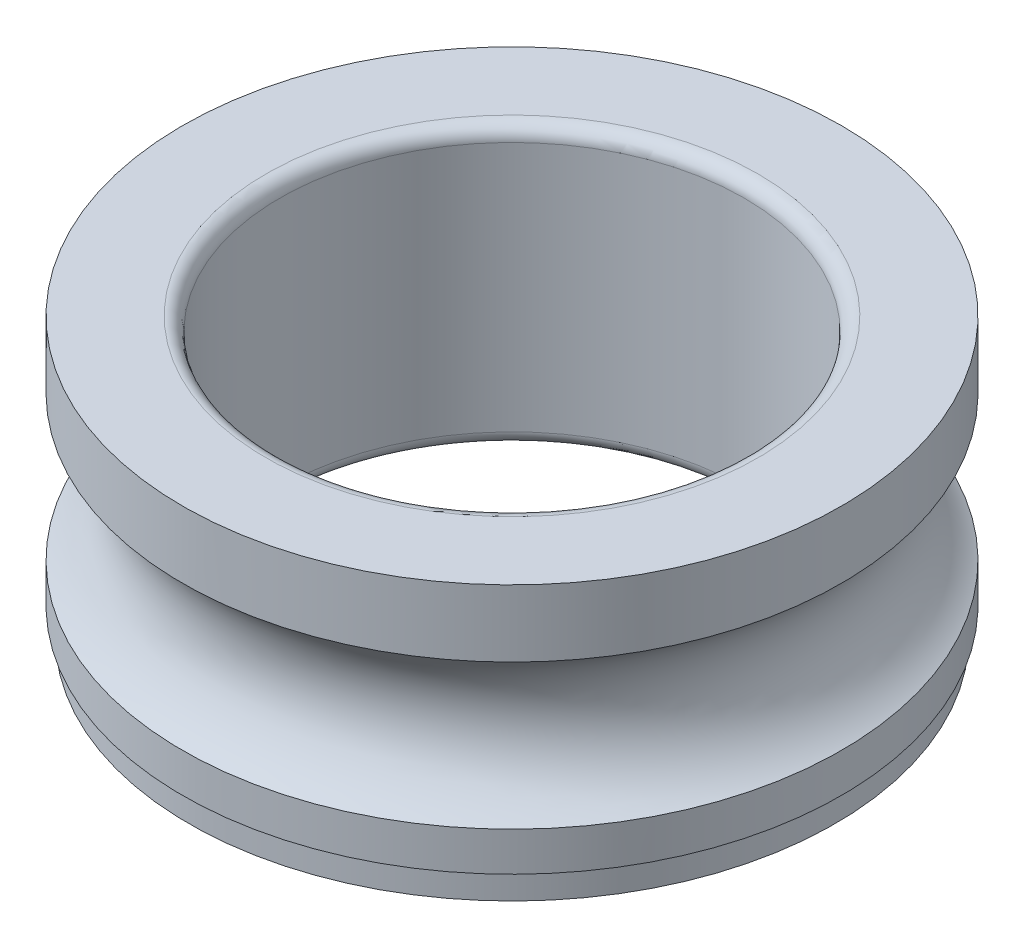
ISO-10303-21;
HEADER;
FILE_DESCRIPTION(('STEP AP214'),'2;1');
FILE_NAME('part.step','',(''),(''),'','','');
FILE_SCHEMA(('AUTOMOTIVE_DESIGN { 1 0 10303 214 1 1 1 1 }'));
ENDSEC;
DATA;
#1=APPLICATION_CONTEXT('core data for automotive mechanical design processes');
#2=APPLICATION_PROTOCOL_DEFINITION('international standard','automotive_design',2000,#1);
#3=PRODUCT_CONTEXT('',#1,'mechanical');
#4=PRODUCT('Part','Part','',(#3));
#5=PRODUCT_RELATED_PRODUCT_CATEGORY('part','',(#4));
#6=PRODUCT_DEFINITION_FORMATION('','',#4);
#7=PRODUCT_DEFINITION_CONTEXT('part definition',#1,'design');
#8=PRODUCT_DEFINITION('design','',#6,#7);
#9=PRODUCT_DEFINITION_SHAPE('','',#8);
#10=(LENGTH_UNIT() NAMED_UNIT(*) SI_UNIT(.MILLI.,.METRE.));
#11=(NAMED_UNIT(*) PLANE_ANGLE_UNIT() SI_UNIT($,.RADIAN.));
#12=(NAMED_UNIT(*) SI_UNIT($,.STERADIAN.) SOLID_ANGLE_UNIT());
#13=UNCERTAINTY_MEASURE_WITH_UNIT(LENGTH_MEASURE(1.E-05),#10,'distance_accuracy_value','');
#14=(GEOMETRIC_REPRESENTATION_CONTEXT(3) GLOBAL_UNCERTAINTY_ASSIGNED_CONTEXT((#13)) GLOBAL_UNIT_ASSIGNED_CONTEXT((#10,
#11,#12)) REPRESENTATION_CONTEXT('',''));
#15=CARTESIAN_POINT('',(0.,0.,0.));
#16=DIRECTION('',(0.,0.,1.));
#17=DIRECTION('',(1.,0.,0.));
#18=AXIS2_PLACEMENT_3D('',#15,#16,#17);
#19=CARTESIAN_POINT('',(0.,-0.3,0.));
#20=DIRECTION('',(0.,1.,0.));
#21=DIRECTION('',(0.,0.,1.));
#22=AXIS2_PLACEMENT_3D('',#19,#20,#21);
#23=CYLINDRICAL_SURFACE('',#22,7.1);
#24=CARTESIAN_POINT('',(0.,0.,0.));
#25=DIRECTION('',(0.,1.,0.));
#26=DIRECTION('',(0.,0.,1.));
#27=AXIS2_PLACEMENT_3D('',#24,#25,#26);
#28=CIRCLE('',#27,7.1);
#29=CARTESIAN_POINT('',(0.,0.,-7.1));
#30=VERTEX_POINT('',#29);
#31=EDGE_CURVE('E11',#30,#30,#28,.T.);
#32=ORIENTED_EDGE('',*,*,#31,.F.);
#33=EDGE_LOOP('',(#32));
#34=FACE_BOUND('',#33,.T.);
#35=CARTESIAN_POINT('',(0.,-1.44115427318801,0.));
#36=DIRECTION('',(0.,1.,0.));
#37=DIRECTION('',(0.,0.,1.));
#38=AXIS2_PLACEMENT_3D('',#35,#36,#37);
#39=CIRCLE('',#38,7.1);
#40=CARTESIAN_POINT('',(6.45838716701708,-1.44115427318801,2.94944659231338));
#41=VERTEX_POINT('',#40);
#42=EDGE_CURVE('E63',#41,#41,#39,.T.);
#43=ORIENTED_EDGE('',*,*,#42,.T.);
#44=EDGE_LOOP('',(#43));
#45=FACE_BOUND('',#44,.T.);
#46=ADVANCED_FACE('F16',(#34,#45),#23,.T.);
#47=CARTESIAN_POINT('',(0.,0.,6.2));
#48=DIRECTION('',(0.,1.,0.));
#49=DIRECTION('',(1.,0.,0.));
#50=AXIS2_PLACEMENT_3D('',#47,#48,#49);
#51=PLANE('',#50);
#52=ORIENTED_EDGE('',*,*,#31,.T.);
#53=EDGE_LOOP('',(#52));
#54=FACE_BOUND('',#53,.T.);
#55=CARTESIAN_POINT('',(0.,0.,0.));
#56=DIRECTION('',(0.,1.,0.));
#57=DIRECTION('',(0.,0.,1.));
#58=AXIS2_PLACEMENT_3D('',#55,#56,#57);
#59=CIRCLE('',#58,5.3);
#60=CARTESIAN_POINT('',(0.,0.,-5.3));
#61=VERTEX_POINT('',#60);
#62=EDGE_CURVE('E73',#61,#61,#59,.T.);
#63=ORIENTED_EDGE('',*,*,#62,.F.);
#64=EDGE_LOOP('',(#63));
#65=FACE_BOUND('',#64,.T.);
#66=ADVANCED_FACE('F122',(#54,#65),#51,.T.);
#67=CARTESIAN_POINT('',(0.,-4.979422863406,0.));
#68=DIRECTION('',(0.,1.,0.));
#69=DIRECTION('',(0.,0.,1.));
#70=AXIS2_PLACEMENT_3D('',#67,#68,#69);
#71=CYLINDRICAL_SURFACE('',#70,7.1);
#72=CARTESIAN_POINT('',(0.,-4.55884572681199,0.));
#73=DIRECTION('',(0.,1.,0.));
#74=DIRECTION('',(0.,0.,1.));
#75=AXIS2_PLACEMENT_3D('',#72,#73,#74);
#76=CIRCLE('',#75,7.1);
#77=CARTESIAN_POINT('',(3.83854980393476,-4.55884572681199,5.97290008310138));
#78=VERTEX_POINT('',#77);
#79=EDGE_CURVE('E104',#78,#78,#76,.T.);
#80=ORIENTED_EDGE('',*,*,#79,.F.);
#81=EDGE_LOOP('',(#80));
#82=FACE_BOUND('',#81,.T.);
#83=CARTESIAN_POINT('',(0.,-5.4,0.));
#84=DIRECTION('',(0.,1.,0.));
#85=DIRECTION('',(0.,0.,1.));
#86=AXIS2_PLACEMENT_3D('',#83,#84,#85);
#87=CIRCLE('',#86,7.1);
#88=CARTESIAN_POINT('',(0.,-5.4,-7.1));
#89=VERTEX_POINT('',#88);
#90=EDGE_CURVE('E27',#89,#89,#87,.T.);
#91=ORIENTED_EDGE('',*,*,#90,.T.);
#92=EDGE_LOOP('',(#91));
#93=FACE_BOUND('',#92,.T.);
#94=ADVANCED_FACE('F118',(#82,#93),#71,.T.);
#95=CARTESIAN_POINT('',(0.,-5.4,7.029));
#96=DIRECTION('',(0.,-1.,0.));
#97=DIRECTION('',(-1.,0.,0.));
#98=AXIS2_PLACEMENT_3D('',#95,#96,#97);
#99=PLANE('',#98);
#100=CARTESIAN_POINT('',(0.,-5.4,0.));
#101=DIRECTION('',(0.,1.,0.));
#102=DIRECTION('',(0.,0.,1.));
#103=AXIS2_PLACEMENT_3D('',#100,#101,#102);
#104=CIRCLE('',#103,6.958);
#105=CARTESIAN_POINT('',(0.,-5.4,-6.958));
#106=VERTEX_POINT('',#105);
#107=EDGE_CURVE('E97',#106,#106,#104,.T.);
#108=ORIENTED_EDGE('',*,*,#107,.T.);
#109=EDGE_LOOP('',(#108));
#110=FACE_BOUND('',#109,.T.);
#111=ORIENTED_EDGE('',*,*,#90,.F.);
#112=EDGE_LOOP('',(#111));
#113=FACE_BOUND('',#112,.T.);
#114=ADVANCED_FACE('F121',(#110,#113),#99,.T.);
#115=CARTESIAN_POINT('',(0.,-3.,0.));
#116=DIRECTION('',(0.,1.,0.));
#117=DIRECTION('',(0.,0.,1.));
#118=AXIS2_PLACEMENT_3D('',#115,#116,#117);
#119=TOROIDAL_SURFACE('',#118,8.,1.8);
#120=ORIENTED_EDGE('',*,*,#79,.T.);
#121=EDGE_LOOP('',(#120));
#122=FACE_BOUND('',#121,.T.);
#123=ORIENTED_EDGE('',*,*,#42,.F.);
#124=EDGE_LOOP('',(#123));
#125=FACE_BOUND('',#124,.T.);
#126=ADVANCED_FACE('F18',(#122,#125),#119,.F.);
#127=CARTESIAN_POINT('',(0.,-0.3,0.));
#128=DIRECTION('',(0.,1.,0.));
#129=DIRECTION('',(0.,0.,1.));
#130=AXIS2_PLACEMENT_3D('',#127,#128,#129);
#131=TOROIDAL_SURFACE('',#130,5.3,0.3);
#132=CARTESIAN_POINT('',(0.,-0.3,0.));
#133=DIRECTION('',(0.,1.,0.));
#134=DIRECTION('',(0.,0.,1.));
#135=AXIS2_PLACEMENT_3D('',#132,#133,#134);
#136=CIRCLE('',#135,5.);
#137=CARTESIAN_POINT('',(0.,-0.3,-5.));
#138=VERTEX_POINT('',#137);
#139=EDGE_CURVE('E81',#138,#138,#136,.T.);
#140=ORIENTED_EDGE('',*,*,#139,.F.);
#141=EDGE_LOOP('',(#140));
#142=FACE_BOUND('',#141,.T.);
#143=ORIENTED_EDGE('',*,*,#62,.T.);
#144=EDGE_LOOP('',(#143));
#145=FACE_BOUND('',#144,.T.);
#146=ADVANCED_FACE('F132',(#142,#145),#131,.T.);
#147=CARTESIAN_POINT('',(0.,-5.7,0.));
#148=DIRECTION('',(0.,1.,0.));
#149=DIRECTION('',(0.,0.,1.));
#150=AXIS2_PLACEMENT_3D('',#147,#148,#149);
#151=CYLINDRICAL_SURFACE('',#150,6.958);
#152=ORIENTED_EDGE('',*,*,#107,.F.);
#153=EDGE_LOOP('',(#152));
#154=FACE_BOUND('',#153,.T.);
#155=CARTESIAN_POINT('',(0.,-6.,0.));
#156=DIRECTION('',(0.,1.,0.));
#157=DIRECTION('',(0.,0.,1.));
#158=AXIS2_PLACEMENT_3D('',#155,#156,#157);
#159=CIRCLE('',#158,6.958);
#160=CARTESIAN_POINT('',(0.,-6.,-6.958));
#161=VERTEX_POINT('',#160);
#162=EDGE_CURVE('E88',#161,#161,#159,.T.);
#163=ORIENTED_EDGE('',*,*,#162,.T.);
#164=EDGE_LOOP('',(#163));
#165=FACE_BOUND('',#164,.T.);
#166=ADVANCED_FACE('F89',(#154,#165),#151,.T.);
#167=CARTESIAN_POINT('',(0.,-3.,0.));
#168=DIRECTION('',(0.,1.,0.));
#169=DIRECTION('',(0.,0.,1.));
#170=AXIS2_PLACEMENT_3D('',#167,#168,#169);
#171=CYLINDRICAL_SURFACE('',#170,5.);
#172=CARTESIAN_POINT('',(0.,-5.7,0.));
#173=DIRECTION('',(0.,1.,0.));
#174=DIRECTION('',(0.,0.,1.));
#175=AXIS2_PLACEMENT_3D('',#172,#173,#174);
#176=CIRCLE('',#175,5.);
#177=CARTESIAN_POINT('',(0.,-5.7,-5.));
#178=VERTEX_POINT('',#177);
#179=EDGE_CURVE('E20',#178,#178,#176,.T.);
#180=ORIENTED_EDGE('',*,*,#179,.F.);
#181=EDGE_LOOP('',(#180));
#182=FACE_BOUND('',#181,.T.);
#183=ORIENTED_EDGE('',*,*,#139,.T.);
#184=EDGE_LOOP('',(#183));
#185=FACE_BOUND('',#184,.T.);
#186=ADVANCED_FACE('F142',(#182,#185),#171,.F.);
#187=CARTESIAN_POINT('',(0.,-6.,6.129));
#188=DIRECTION('',(0.,-1.,0.));
#189=DIRECTION('',(-1.,0.,0.));
#190=AXIS2_PLACEMENT_3D('',#187,#188,#189);
#191=PLANE('',#190);
#192=CARTESIAN_POINT('',(0.,-6.,0.));
#193=DIRECTION('',(0.,1.,0.));
#194=DIRECTION('',(0.,0.,1.));
#195=AXIS2_PLACEMENT_3D('',#192,#193,#194);
#196=CIRCLE('',#195,5.3);
#197=CARTESIAN_POINT('',(0.,-6.,-5.3));
#198=VERTEX_POINT('',#197);
#199=EDGE_CURVE('E92',#198,#198,#196,.T.);
#200=ORIENTED_EDGE('',*,*,#199,.T.);
#201=EDGE_LOOP('',(#200));
#202=FACE_BOUND('',#201,.T.);
#203=ORIENTED_EDGE('',*,*,#162,.F.);
#204=EDGE_LOOP('',(#203));
#205=FACE_BOUND('',#204,.T.);
#206=ADVANCED_FACE('F152',(#202,#205),#191,.T.);
#207=CARTESIAN_POINT('',(0.,-5.7,0.));
#208=DIRECTION('',(0.,1.,0.));
#209=DIRECTION('',(0.,0.,1.));
#210=AXIS2_PLACEMENT_3D('',#207,#208,#209);
#211=TOROIDAL_SURFACE('',#210,5.3,0.3);
#212=ORIENTED_EDGE('',*,*,#199,.F.);
#213=EDGE_LOOP('',(#212));
#214=FACE_BOUND('',#213,.T.);
#215=ORIENTED_EDGE('',*,*,#179,.T.);
#216=EDGE_LOOP('',(#215));
#217=FACE_BOUND('',#216,.T.);
#218=ADVANCED_FACE('F150',(#214,#217),#211,.T.);
#219=CLOSED_SHELL('',(#46,#66,#94,#114,#126,#146,#166,#186,#206,#218));
#220=MANIFOLD_SOLID_BREP('B1',#219);
#221=ADVANCED_BREP_SHAPE_REPRESENTATION('',(#18,#220),#14);
#222=SHAPE_DEFINITION_REPRESENTATION(#9,#221);
ENDSEC;
END-ISO-10303-21;
